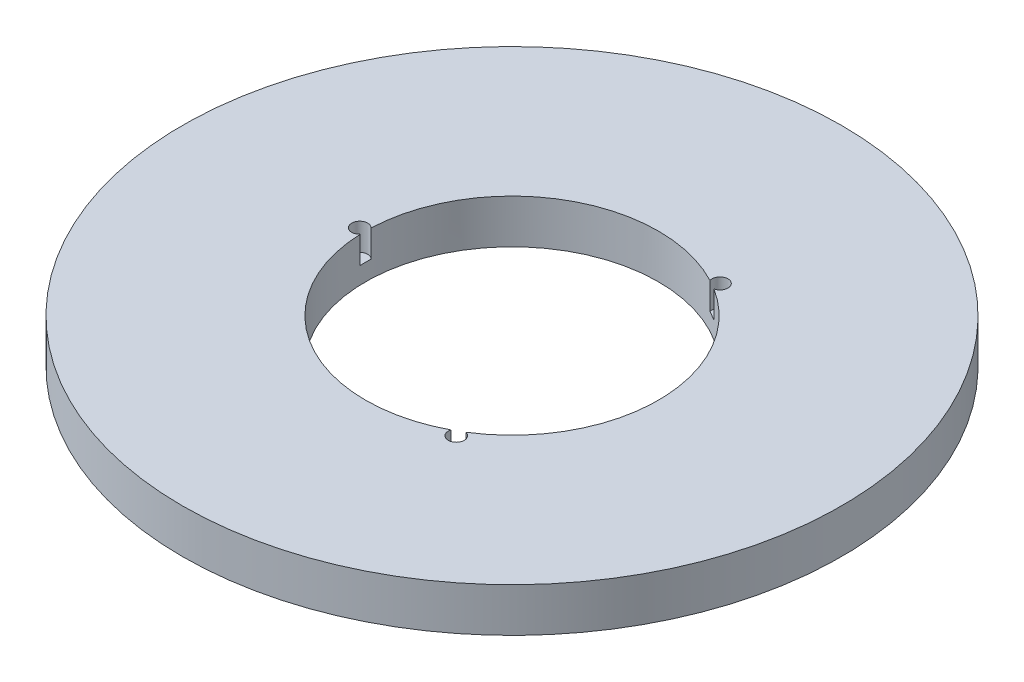
ISO-10303-21;
HEADER;
FILE_DESCRIPTION(('STEP AP214'),'2;1');
FILE_NAME('part.step','',(''),(''),'','','');
FILE_SCHEMA(('AUTOMOTIVE_DESIGN { 1 0 10303 214 1 1 1 1 }'));
ENDSEC;
DATA;
#1=APPLICATION_CONTEXT('core data for automotive mechanical design processes');
#2=APPLICATION_PROTOCOL_DEFINITION('international standard','automotive_design',2000,#1);
#3=PRODUCT_CONTEXT('',#1,'mechanical');
#4=PRODUCT('Part','Part','',(#3));
#5=PRODUCT_RELATED_PRODUCT_CATEGORY('part','',(#4));
#6=PRODUCT_DEFINITION_FORMATION('','',#4);
#7=PRODUCT_DEFINITION_CONTEXT('part definition',#1,'design');
#8=PRODUCT_DEFINITION('design','',#6,#7);
#9=PRODUCT_DEFINITION_SHAPE('','',#8);
#10=(LENGTH_UNIT() NAMED_UNIT(*) SI_UNIT(.MILLI.,.METRE.));
#11=(NAMED_UNIT(*) PLANE_ANGLE_UNIT() SI_UNIT($,.RADIAN.));
#12=(NAMED_UNIT(*) SI_UNIT($,.STERADIAN.) SOLID_ANGLE_UNIT());
#13=UNCERTAINTY_MEASURE_WITH_UNIT(LENGTH_MEASURE(1.E-05),#10,'distance_accuracy_value','');
#14=(GEOMETRIC_REPRESENTATION_CONTEXT(3) GLOBAL_UNCERTAINTY_ASSIGNED_CONTEXT((#13)) GLOBAL_UNIT_ASSIGNED_CONTEXT((#10,
#11,#12)) REPRESENTATION_CONTEXT('',''));
#15=CARTESIAN_POINT('',(0.,0.,0.));
#16=DIRECTION('',(0.,0.,1.));
#17=DIRECTION('',(1.,0.,0.));
#18=AXIS2_PLACEMENT_3D('',#15,#16,#17);
#19=CARTESIAN_POINT('',(0.,12.,0.));
#20=DIRECTION('',(0.,-1.,0.));
#21=DIRECTION('',(0.,0.,-1.));
#22=AXIS2_PLACEMENT_3D('',#19,#20,#21);
#23=CYLINDRICAL_SURFACE('',#22,90.);
#24=CARTESIAN_POINT('',(0.,12.,0.));
#25=DIRECTION('',(0.,1.,0.));
#26=DIRECTION('',(0.,0.,1.));
#27=AXIS2_PLACEMENT_3D('',#24,#25,#26);
#28=CIRCLE('',#27,90.);
#29=CARTESIAN_POINT('',(0.,12.,90.));
#30=VERTEX_POINT('',#29);
#31=EDGE_CURVE('E126',#30,#30,#28,.T.);
#32=ORIENTED_EDGE('',*,*,#31,.F.);
#33=EDGE_LOOP('',(#32));
#34=FACE_BOUND('',#33,.T.);
#35=CARTESIAN_POINT('',(0.,0.,0.));
#36=DIRECTION('',(0.,1.,0.));
#37=DIRECTION('',(0.,0.,1.));
#38=AXIS2_PLACEMENT_3D('',#35,#36,#37);
#39=CIRCLE('',#38,90.);
#40=CARTESIAN_POINT('',(0.,0.,90.));
#41=VERTEX_POINT('',#40);
#42=EDGE_CURVE('E124',#41,#41,#39,.T.);
#43=ORIENTED_EDGE('',*,*,#42,.T.);
#44=EDGE_LOOP('',(#43));
#45=FACE_BOUND('',#44,.T.);
#46=ADVANCED_FACE('F39',(#34,#45),#23,.T.);
#47=CARTESIAN_POINT('',(0.,12.,0.));
#48=DIRECTION('',(0.,1.,0.));
#49=DIRECTION('',(0.,0.,1.));
#50=AXIS2_PLACEMENT_3D('',#47,#48,#49);
#51=PLANE('',#50);
#52=CARTESIAN_POINT('',(20.7933489521411,12.,36.015136844617));
#53=DIRECTION('',(0.,1.,0.));
#54=DIRECTION('',(0.866025403784436,0.,-0.500000000000004));
#55=AXIS2_PLACEMENT_3D('',#52,#53,#54);
#56=CIRCLE('',#55,2.18407863166555);
#57=CARTESIAN_POINT('',(18.7119260604359,12.,35.3534131748093));
#58=VERTEX_POINT('',#57);
#59=CARTESIAN_POINT('',(21.2609908896547,12.,33.881709909478));
#60=VERTEX_POINT('',#59);
#61=EDGE_CURVE('E147',#58,#60,#56,.T.);
#62=ORIENTED_EDGE('',*,*,#61,.F.);
#63=CARTESIAN_POINT('',(0.,12.,0.));
#64=DIRECTION('',(0.,1.,0.));
#65=DIRECTION('',(0.,0.,1.));
#66=AXIS2_PLACEMENT_3D('',#63,#64,#65);
#67=CIRCLE('',#66,40.);
#68=CARTESIAN_POINT('',(-39.9729169500903,12.,1.47170326533129));
#69=VERTEX_POINT('',#68);
#70=EDGE_CURVE('E118',#69,#58,#67,.T.);
#71=ORIENTED_EDGE('',*,*,#70,.F.);
#72=CARTESIAN_POINT('',(-41.5866979042818,12.,0.));
#73=DIRECTION('',(0.,1.,0.));
#74=DIRECTION('',(0.,0.,1.));
#75=AXIS2_PLACEMENT_3D('',#72,#73,#74);
#76=CIRCLE('',#75,2.18407863166555);
#77=CARTESIAN_POINT('',(-39.9729169500903,12.,-1.47170326533129));
#78=VERTEX_POINT('',#77);
#79=EDGE_CURVE('E113',#78,#69,#76,.T.);
#80=ORIENTED_EDGE('',*,*,#79,.F.);
#81=CARTESIAN_POINT('',(18.7119260604354,12.,-35.3534131748096));
#82=VERTEX_POINT('',#81);
#83=EDGE_CURVE('E106',#82,#78,#67,.T.);
#84=ORIENTED_EDGE('',*,*,#83,.F.);
#85=CARTESIAN_POINT('',(20.7933489521406,12.,-36.0151368446173));
#86=DIRECTION('',(0.,1.,0.));
#87=DIRECTION('',(-0.866025403784443,0.,-0.499999999999992));
#88=AXIS2_PLACEMENT_3D('',#85,#86,#87);
#89=CIRCLE('',#88,2.18407863166555);
#90=CARTESIAN_POINT('',(21.2609908896542,12.,-33.8817099094783));
#91=VERTEX_POINT('',#90);
#92=EDGE_CURVE('E90',#91,#82,#89,.T.);
#93=ORIENTED_EDGE('',*,*,#92,.F.);
#94=EDGE_CURVE('E116',#60,#91,#67,.T.);
#95=ORIENTED_EDGE('',*,*,#94,.F.);
#96=EDGE_LOOP('',(#62,#71,#80,#84,#93,#95));
#97=FACE_BOUND('',#96,.T.);
#98=ORIENTED_EDGE('',*,*,#31,.T.);
#99=EDGE_LOOP('',(#98));
#100=FACE_BOUND('',#99,.T.);
#101=ADVANCED_FACE('F115',(#97,#100),#51,.T.);
#102=CARTESIAN_POINT('',(0.,0.,0.));
#103=DIRECTION('',(0.,1.,0.));
#104=DIRECTION('',(0.,0.,1.));
#105=AXIS2_PLACEMENT_3D('',#102,#103,#104);
#106=PLANE('',#105);
#107=CARTESIAN_POINT('',(0.,0.,0.));
#108=DIRECTION('',(0.,1.,0.));
#109=DIRECTION('',(0.,0.,1.));
#110=AXIS2_PLACEMENT_3D('',#107,#108,#109);
#111=CIRCLE('',#110,40.);
#112=CARTESIAN_POINT('',(0.,0.,40.));
#113=VERTEX_POINT('',#112);
#114=EDGE_CURVE('E120',#113,#113,#111,.T.);
#115=ORIENTED_EDGE('',*,*,#114,.T.);
#116=EDGE_LOOP('',(#115));
#117=FACE_BOUND('',#116,.T.);
#118=ORIENTED_EDGE('',*,*,#42,.F.);
#119=EDGE_LOOP('',(#118));
#120=FACE_BOUND('',#119,.T.);
#121=ADVANCED_FACE('F164',(#117,#120),#106,.F.);
#122=CARTESIAN_POINT('',(0.,12.,0.));
#123=DIRECTION('',(0.,-1.,0.));
#124=DIRECTION('',(0.,0.,-1.));
#125=AXIS2_PLACEMENT_3D('',#122,#123,#124);
#126=CYLINDRICAL_SURFACE('',#125,40.);
#127=DIRECTION('',(0.,1.,0.));
#128=VECTOR('',#127,1.);
#129=CARTESIAN_POINT('',(18.7119260604359,8.31071576795397,35.3534131748093));
#130=LINE('',#129,#128);
#131=CARTESIAN_POINT('',(18.7119260604359,4.62143153590795,35.3534131748093));
#132=VERTEX_POINT('',#131);
#133=EDGE_CURVE('E11',#132,#58,#130,.T.);
#134=ORIENTED_EDGE('',*,*,#133,.F.);
#135=CARTESIAN_POINT('',(0.,4.62143153590795,0.));
#136=DIRECTION('',(0.,1.,0.));
#137=DIRECTION('',(0.,0.,1.));
#138=AXIS2_PLACEMENT_3D('',#135,#136,#137);
#139=CIRCLE('',#138,40.);
#140=CARTESIAN_POINT('',(21.2609908896547,4.62143153590795,33.881709909478));
#141=VERTEX_POINT('',#140);
#142=EDGE_CURVE('E144',#132,#141,#139,.T.);
#143=ORIENTED_EDGE('',*,*,#142,.T.);
#144=DIRECTION('',(0.,1.,0.));
#145=VECTOR('',#144,1.);
#146=CARTESIAN_POINT('',(21.2609908896547,8.31071576795397,33.881709909478));
#147=LINE('',#146,#145);
#148=EDGE_CURVE('E46',#60,#141,#147,.F.);
#149=ORIENTED_EDGE('',*,*,#148,.F.);
#150=ORIENTED_EDGE('',*,*,#94,.T.);
#151=DIRECTION('',(0.,1.,0.));
#152=VECTOR('',#151,1.);
#153=CARTESIAN_POINT('',(21.2609908896542,8.31071576795397,-33.8817099094783));
#154=LINE('',#153,#152);
#155=CARTESIAN_POINT('',(21.2609908896542,4.62143153590795,-33.8817099094783));
#156=VERTEX_POINT('',#155);
#157=EDGE_CURVE('E92',#156,#91,#154,.T.);
#158=ORIENTED_EDGE('',*,*,#157,.F.);
#159=CARTESIAN_POINT('',(0.,4.62143153590795,0.));
#160=DIRECTION('',(0.,1.,0.));
#161=DIRECTION('',(0.,0.,1.));
#162=AXIS2_PLACEMENT_3D('',#159,#160,#161);
#163=CIRCLE('',#162,40.);
#164=CARTESIAN_POINT('',(18.7119260604354,4.62143153590795,-35.3534131748096));
#165=VERTEX_POINT('',#164);
#166=EDGE_CURVE('E107',#156,#165,#163,.T.);
#167=ORIENTED_EDGE('',*,*,#166,.T.);
#168=DIRECTION('',(0.,1.,0.));
#169=VECTOR('',#168,1.);
#170=CARTESIAN_POINT('',(18.7119260604354,8.31071576795397,-35.3534131748096));
#171=LINE('',#170,#169);
#172=EDGE_CURVE('E95',#82,#165,#171,.F.);
#173=ORIENTED_EDGE('',*,*,#172,.F.);
#174=ORIENTED_EDGE('',*,*,#83,.T.);
#175=DIRECTION('',(0.,1.,0.));
#176=VECTOR('',#175,1.);
#177=CARTESIAN_POINT('',(-39.9729169500903,8.31071576795397,-1.47170326533129));
#178=LINE('',#177,#176);
#179=CARTESIAN_POINT('',(-39.9729169500903,4.62143153590795,-1.47170326533129));
#180=VERTEX_POINT('',#179);
#181=EDGE_CURVE('E143',#180,#78,#178,.T.);
#182=ORIENTED_EDGE('',*,*,#181,.F.);
#183=CARTESIAN_POINT('',(0.,4.62143153590795,0.));
#184=DIRECTION('',(0.,1.,0.));
#185=DIRECTION('',(0.,0.,1.));
#186=AXIS2_PLACEMENT_3D('',#183,#184,#185);
#187=CIRCLE('',#186,40.);
#188=CARTESIAN_POINT('',(-39.9729169500903,4.62143153590795,1.47170326533129));
#189=VERTEX_POINT('',#188);
#190=EDGE_CURVE('E132',#180,#189,#187,.T.);
#191=ORIENTED_EDGE('',*,*,#190,.T.);
#192=DIRECTION('',(0.,1.,0.));
#193=VECTOR('',#192,1.);
#194=CARTESIAN_POINT('',(-39.9729169500903,8.31071576795397,1.47170326533129));
#195=LINE('',#194,#193);
#196=EDGE_CURVE('E137',#69,#189,#195,.F.);
#197=ORIENTED_EDGE('',*,*,#196,.F.);
#198=ORIENTED_EDGE('',*,*,#70,.T.);
#199=EDGE_LOOP('',(#134,#143,#149,#150,#158,#167,#173,#174,#182,#191,#197,#198));
#200=FACE_BOUND('',#199,.T.);
#201=ORIENTED_EDGE('',*,*,#114,.F.);
#202=EDGE_LOOP('',(#201));
#203=FACE_BOUND('',#202,.T.);
#204=ADVANCED_FACE('F103',(#200,#203),#126,.F.);
#205=CARTESIAN_POINT('',(-41.5866979042818,4.62143153590795,0.));
#206=DIRECTION('',(0.,1.,0.));
#207=DIRECTION('',(0.,0.,1.));
#208=AXIS2_PLACEMENT_3D('',#205,#206,#207);
#209=CYLINDRICAL_SURFACE('',#208,2.18407863166555);
#210=ORIENTED_EDGE('',*,*,#181,.T.);
#211=ORIENTED_EDGE('',*,*,#79,.T.);
#212=ORIENTED_EDGE('',*,*,#196,.T.);
#213=CARTESIAN_POINT('',(-41.5866979042818,4.62143153590795,0.));
#214=DIRECTION('',(0.,1.,0.));
#215=DIRECTION('',(0.,0.,1.));
#216=AXIS2_PLACEMENT_3D('',#213,#214,#215);
#217=CIRCLE('',#216,2.18407863166555);
#218=EDGE_CURVE('E121',#180,#189,#217,.T.);
#219=ORIENTED_EDGE('',*,*,#218,.F.);
#220=EDGE_LOOP('',(#210,#211,#212,#219));
#221=FACE_BOUND('',#220,.T.);
#222=ADVANCED_FACE('F174',(#221),#209,.F.);
#223=CARTESIAN_POINT('',(-41.5866979042818,4.62143153590795,0.));
#224=DIRECTION('',(0.,1.,0.));
#225=DIRECTION('',(0.,0.,1.));
#226=AXIS2_PLACEMENT_3D('',#223,#224,#225);
#227=PLANE('',#226);
#228=ORIENTED_EDGE('',*,*,#218,.T.);
#229=ORIENTED_EDGE('',*,*,#190,.F.);
#230=EDGE_LOOP('',(#228,#229));
#231=FACE_BOUND('',#230,.T.);
#232=ADVANCED_FACE('F177',(#231),#227,.T.);
#233=CARTESIAN_POINT('',(20.7933489521406,4.62143153590795,-36.0151368446173));
#234=DIRECTION('',(0.,1.,0.));
#235=DIRECTION('',(0.,0.,1.));
#236=AXIS2_PLACEMENT_3D('',#233,#234,#235);
#237=CYLINDRICAL_SURFACE('',#236,2.18407863166555);
#238=ORIENTED_EDGE('',*,*,#157,.T.);
#239=ORIENTED_EDGE('',*,*,#92,.T.);
#240=ORIENTED_EDGE('',*,*,#172,.T.);
#241=CARTESIAN_POINT('',(20.7933489521406,4.62143153590795,-36.0151368446173));
#242=DIRECTION('',(0.,1.,0.));
#243=DIRECTION('',(-0.866025403784443,0.,-0.499999999999992));
#244=AXIS2_PLACEMENT_3D('',#241,#242,#243);
#245=CIRCLE('',#244,2.18407863166555);
#246=EDGE_CURVE('E56',#156,#165,#245,.T.);
#247=ORIENTED_EDGE('',*,*,#246,.F.);
#248=EDGE_LOOP('',(#238,#239,#240,#247));
#249=FACE_BOUND('',#248,.T.);
#250=ADVANCED_FACE('F93',(#249),#237,.F.);
#251=CARTESIAN_POINT('',(20.7933489521406,4.62143153590795,-36.0151368446173));
#252=DIRECTION('',(0.,1.,0.));
#253=DIRECTION('',(-0.866025403784443,0.,-0.499999999999992));
#254=AXIS2_PLACEMENT_3D('',#251,#252,#253);
#255=PLANE('',#254);
#256=ORIENTED_EDGE('',*,*,#246,.T.);
#257=ORIENTED_EDGE('',*,*,#166,.F.);
#258=EDGE_LOOP('',(#256,#257));
#259=FACE_BOUND('',#258,.T.);
#260=ADVANCED_FACE('F160',(#259),#255,.T.);
#261=CARTESIAN_POINT('',(20.7933489521411,4.62143153590795,36.015136844617));
#262=DIRECTION('',(0.,1.,0.));
#263=DIRECTION('',(0.,0.,1.));
#264=AXIS2_PLACEMENT_3D('',#261,#262,#263);
#265=CYLINDRICAL_SURFACE('',#264,2.18407863166555);
#266=ORIENTED_EDGE('',*,*,#133,.T.);
#267=ORIENTED_EDGE('',*,*,#61,.T.);
#268=ORIENTED_EDGE('',*,*,#148,.T.);
#269=CARTESIAN_POINT('',(20.7933489521411,4.62143153590795,36.015136844617));
#270=DIRECTION('',(0.,1.,0.));
#271=DIRECTION('',(0.866025403784436,0.,-0.500000000000004));
#272=AXIS2_PLACEMENT_3D('',#269,#270,#271);
#273=CIRCLE('',#272,2.18407863166555);
#274=EDGE_CURVE('E55',#132,#141,#273,.T.);
#275=ORIENTED_EDGE('',*,*,#274,.F.);
#276=EDGE_LOOP('',(#266,#267,#268,#275));
#277=FACE_BOUND('',#276,.T.);
#278=ADVANCED_FACE('F149',(#277),#265,.F.);
#279=CARTESIAN_POINT('',(20.7933489521411,4.62143153590795,36.015136844617));
#280=DIRECTION('',(0.,1.,0.));
#281=DIRECTION('',(0.866025403784436,0.,-0.500000000000004));
#282=AXIS2_PLACEMENT_3D('',#279,#280,#281);
#283=PLANE('',#282);
#284=ORIENTED_EDGE('',*,*,#274,.T.);
#285=ORIENTED_EDGE('',*,*,#142,.F.);
#286=EDGE_LOOP('',(#284,#285));
#287=FACE_BOUND('',#286,.T.);
#288=ADVANCED_FACE('F151',(#287),#283,.T.);
#289=CLOSED_SHELL('',(#46,#101,#121,#204,#222,#232,#250,#260,#278,#288));
#290=MANIFOLD_SOLID_BREP('B2',#289);
#291=ADVANCED_BREP_SHAPE_REPRESENTATION('',(#18,#290),#14);
#292=SHAPE_DEFINITION_REPRESENTATION(#9,#291);
ENDSEC;
END-ISO-10303-21;
